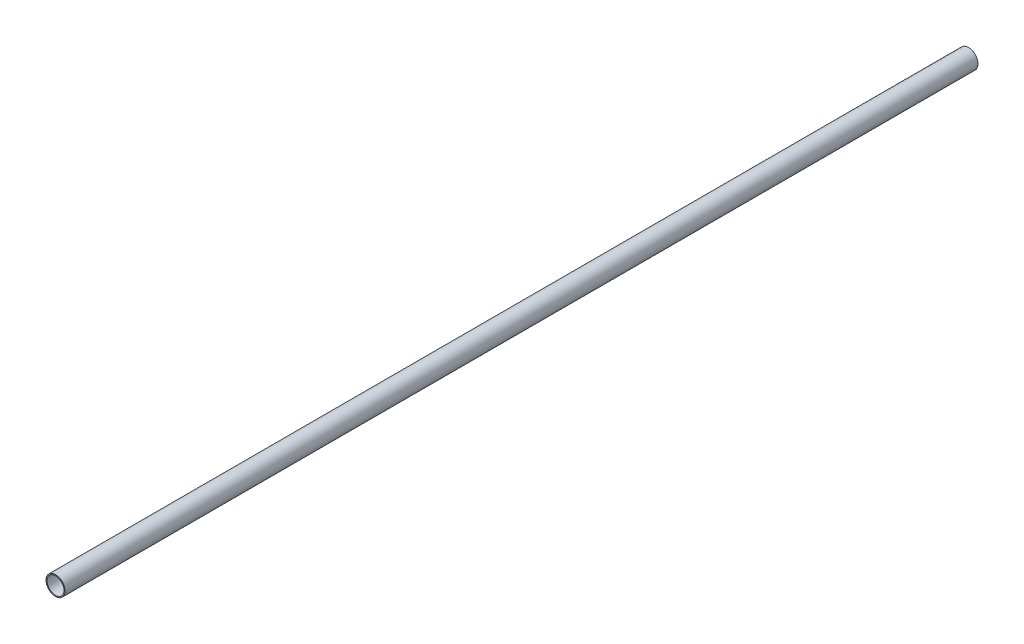
ISO-10303-21;
HEADER;
FILE_DESCRIPTION(('STEP AP214'),'2;1');
FILE_NAME('part.step','',(''),(''),'','','');
FILE_SCHEMA(('AUTOMOTIVE_DESIGN { 1 0 10303 214 1 1 1 1 }'));
ENDSEC;
DATA;
#1=APPLICATION_CONTEXT('core data for automotive mechanical design processes');
#2=APPLICATION_PROTOCOL_DEFINITION('international standard','automotive_design',2000,#1);
#3=PRODUCT_CONTEXT('',#1,'mechanical');
#4=PRODUCT('Part','Part','',(#3));
#5=PRODUCT_RELATED_PRODUCT_CATEGORY('part','',(#4));
#6=PRODUCT_DEFINITION_FORMATION('','',#4);
#7=PRODUCT_DEFINITION_CONTEXT('part definition',#1,'design');
#8=PRODUCT_DEFINITION('design','',#6,#7);
#9=PRODUCT_DEFINITION_SHAPE('','',#8);
#10=(LENGTH_UNIT() NAMED_UNIT(*) SI_UNIT(.MILLI.,.METRE.));
#11=(NAMED_UNIT(*) PLANE_ANGLE_UNIT() SI_UNIT($,.RADIAN.));
#12=(NAMED_UNIT(*) SI_UNIT($,.STERADIAN.) SOLID_ANGLE_UNIT());
#13=UNCERTAINTY_MEASURE_WITH_UNIT(LENGTH_MEASURE(1.E-05),#10,'distance_accuracy_value','');
#14=(GEOMETRIC_REPRESENTATION_CONTEXT(3) GLOBAL_UNCERTAINTY_ASSIGNED_CONTEXT((#13)) GLOBAL_UNIT_ASSIGNED_CONTEXT((#10,
#11,#12)) REPRESENTATION_CONTEXT('',''));
#15=CARTESIAN_POINT('',(0.,0.,0.));
#16=DIRECTION('',(0.,0.,1.));
#17=DIRECTION('',(1.,0.,0.));
#18=AXIS2_PLACEMENT_3D('',#15,#16,#17);
#19=CARTESIAN_POINT('',(0.,0.,5486.4));
#20=DIRECTION('',(0.,0.,1.));
#21=DIRECTION('',(1.,0.,0.));
#22=AXIS2_PLACEMENT_3D('',#19,#20,#21);
#23=PLANE('',#22);
#24=CARTESIAN_POINT('',(0.,0.,5486.4));
#25=DIRECTION('',(0.,0.,1.));
#26=DIRECTION('',(1.,0.,0.));
#27=AXIS2_PLACEMENT_3D('',#24,#25,#26);
#28=CIRCLE('',#27,57.15);
#29=CARTESIAN_POINT('',(57.15,0.,5486.4));
#30=VERTEX_POINT('',#29);
#31=EDGE_CURVE('E10',#30,#30,#28,.T.);
#32=ORIENTED_EDGE('',*,*,#31,.T.);
#33=EDGE_LOOP('',(#32));
#34=FACE_BOUND('',#33,.T.);
#35=CARTESIAN_POINT('',(0.,0.,5486.4));
#36=DIRECTION('',(0.,0.,1.));
#37=DIRECTION('',(1.,0.,0.));
#38=AXIS2_PLACEMENT_3D('',#35,#36,#37);
#39=CIRCLE('',#38,51.1302);
#40=CARTESIAN_POINT('',(51.1302,0.,5486.4));
#41=VERTEX_POINT('',#40);
#42=EDGE_CURVE('E39',#41,#41,#39,.T.);
#43=ORIENTED_EDGE('',*,*,#42,.F.);
#44=EDGE_LOOP('',(#43));
#45=FACE_BOUND('',#44,.T.);
#46=ADVANCED_FACE('F28',(#34,#45),#23,.T.);
#47=CARTESIAN_POINT('',(0.,0.,0.));
#48=DIRECTION('',(0.,0.,1.));
#49=DIRECTION('',(1.,0.,0.));
#50=AXIS2_PLACEMENT_3D('',#47,#48,#49);
#51=PLANE('',#50);
#52=CARTESIAN_POINT('',(0.,0.,0.));
#53=DIRECTION('',(0.,0.,1.));
#54=DIRECTION('',(1.,0.,0.));
#55=AXIS2_PLACEMENT_3D('',#52,#53,#54);
#56=CIRCLE('',#55,57.15);
#57=CARTESIAN_POINT('',(57.15,0.,0.));
#58=VERTEX_POINT('',#57);
#59=EDGE_CURVE('E32',#58,#58,#56,.T.);
#60=ORIENTED_EDGE('',*,*,#59,.F.);
#61=EDGE_LOOP('',(#60));
#62=FACE_BOUND('',#61,.T.);
#63=CARTESIAN_POINT('',(0.,0.,0.));
#64=DIRECTION('',(0.,0.,1.));
#65=DIRECTION('',(1.,0.,0.));
#66=AXIS2_PLACEMENT_3D('',#63,#64,#65);
#67=CIRCLE('',#66,51.1302);
#68=CARTESIAN_POINT('',(51.1302,0.,0.));
#69=VERTEX_POINT('',#68);
#70=EDGE_CURVE('E41',#69,#69,#67,.T.);
#71=ORIENTED_EDGE('',*,*,#70,.T.);
#72=EDGE_LOOP('',(#71));
#73=FACE_BOUND('',#72,.T.);
#74=ADVANCED_FACE('F51',(#62,#73),#51,.F.);
#75=CARTESIAN_POINT('',(0.,0.,5486.4));
#76=DIRECTION('',(0.,0.,-1.));
#77=DIRECTION('',(-1.,0.,0.));
#78=AXIS2_PLACEMENT_3D('',#75,#76,#77);
#79=CYLINDRICAL_SURFACE('',#78,57.15);
#80=ORIENTED_EDGE('',*,*,#31,.F.);
#81=EDGE_LOOP('',(#80));
#82=FACE_BOUND('',#81,.T.);
#83=ORIENTED_EDGE('',*,*,#59,.T.);
#84=EDGE_LOOP('',(#83));
#85=FACE_BOUND('',#84,.T.);
#86=ADVANCED_FACE('F30',(#82,#85),#79,.T.);
#87=CARTESIAN_POINT('',(0.,0.,5486.4));
#88=DIRECTION('',(0.,0.,-1.));
#89=DIRECTION('',(-1.,0.,0.));
#90=AXIS2_PLACEMENT_3D('',#87,#88,#89);
#91=CYLINDRICAL_SURFACE('',#90,51.1302);
#92=ORIENTED_EDGE('',*,*,#42,.T.);
#93=EDGE_LOOP('',(#92));
#94=FACE_BOUND('',#93,.T.);
#95=ORIENTED_EDGE('',*,*,#70,.F.);
#96=EDGE_LOOP('',(#95));
#97=FACE_BOUND('',#96,.T.);
#98=ADVANCED_FACE('F47',(#94,#97),#91,.F.);
#99=CLOSED_SHELL('',(#46,#74,#86,#98));
#100=MANIFOLD_SOLID_BREP('B2',#99);
#101=ADVANCED_BREP_SHAPE_REPRESENTATION('',(#18,#100),#14);
#102=SHAPE_DEFINITION_REPRESENTATION(#9,#101);
ENDSEC;
END-ISO-10303-21;
